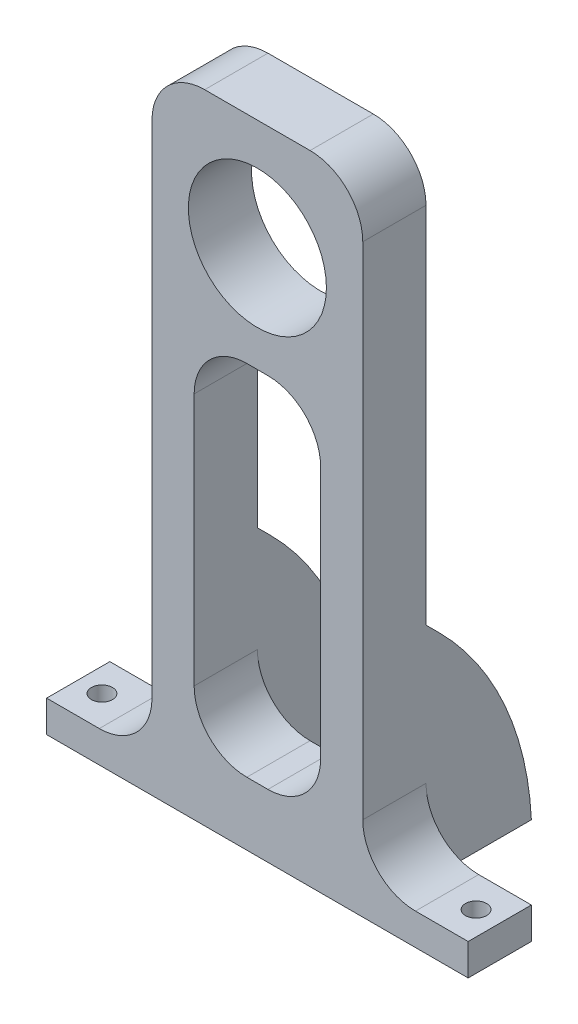
ISO-10303-21;
HEADER;
FILE_DESCRIPTION(('STEP AP214'),'2;1');
FILE_NAME('part.step','',(''),(''),'','','');
FILE_SCHEMA(('AUTOMOTIVE_DESIGN { 1 0 10303 214 1 1 1 1 }'));
ENDSEC;
DATA;
#1=APPLICATION_CONTEXT('core data for automotive mechanical design processes');
#2=APPLICATION_PROTOCOL_DEFINITION('international standard','automotive_design',2000,#1);
#3=PRODUCT_CONTEXT('',#1,'mechanical');
#4=PRODUCT('Part','Part','',(#3));
#5=PRODUCT_RELATED_PRODUCT_CATEGORY('part','',(#4));
#6=PRODUCT_DEFINITION_FORMATION('','',#4);
#7=PRODUCT_DEFINITION_CONTEXT('part definition',#1,'design');
#8=PRODUCT_DEFINITION('design','',#6,#7);
#9=PRODUCT_DEFINITION_SHAPE('','',#8);
#10=(LENGTH_UNIT() NAMED_UNIT(*) SI_UNIT(.MILLI.,.METRE.));
#11=(NAMED_UNIT(*) PLANE_ANGLE_UNIT() SI_UNIT($,.RADIAN.));
#12=(NAMED_UNIT(*) SI_UNIT($,.STERADIAN.) SOLID_ANGLE_UNIT());
#13=UNCERTAINTY_MEASURE_WITH_UNIT(LENGTH_MEASURE(1.E-05),#10,'distance_accuracy_value','');
#14=(GEOMETRIC_REPRESENTATION_CONTEXT(3) GLOBAL_UNCERTAINTY_ASSIGNED_CONTEXT((#13)) GLOBAL_UNIT_ASSIGNED_CONTEXT((#10,
#11,#12)) REPRESENTATION_CONTEXT('',''));
#15=CARTESIAN_POINT('',(0.,0.,0.));
#16=DIRECTION('',(0.,0.,1.));
#17=DIRECTION('',(1.,0.,0.));
#18=AXIS2_PLACEMENT_3D('',#15,#16,#17);
#19=CARTESIAN_POINT('',(-132.231048069346,30.1944444444444,0.));
#20=DIRECTION('',(0.,0.,1.));
#21=DIRECTION('',(1.,0.,0.));
#22=AXIS2_PLACEMENT_3D('',#19,#20,#21);
#23=PLANE('',#22);
#24=DIRECTION('',(0.,1.,0.));
#25=VECTOR('',#24,1.);
#26=CARTESIAN_POINT('',(-162.231048069346,-58.8055555555556,0.));
#27=LINE('',#26,#25);
#28=CARTESIAN_POINT('',(-162.231048069346,-80.8055555555556,0.));
#29=VERTEX_POINT('',#28);
#30=CARTESIAN_POINT('',(-162.231048069346,-64.8055555555556,0.));
#31=VERTEX_POINT('',#30);
#32=EDGE_CURVE('E229',#29,#31,#27,.T.);
#33=ORIENTED_EDGE('',*,*,#32,.F.);
#34=DIRECTION('',(1.,0.,0.));
#35=VECTOR('',#34,1.);
#36=CARTESIAN_POINT('',(-182.231048069346,-80.8055555555556,0.));
#37=LINE('',#36,#35);
#38=CARTESIAN_POINT('',(-182.231048069346,-80.8055555555556,0.));
#39=VERTEX_POINT('',#38);
#40=EDGE_CURVE('E359',#39,#29,#37,.T.);
#41=ORIENTED_EDGE('',*,*,#40,.F.);
#42=DIRECTION('',(0.,-1.,0.));
#43=VECTOR('',#42,1.);
#44=CARTESIAN_POINT('',(-182.231048069346,-74.8055555555556,0.));
#45=LINE('',#44,#43);
#46=CARTESIAN_POINT('',(-182.231048069346,-74.8055555555556,0.));
#47=VERTEX_POINT('',#46);
#48=EDGE_CURVE('E356',#47,#39,#45,.T.);
#49=ORIENTED_EDGE('',*,*,#48,.F.);
#50=DIRECTION('',(-1.,0.,0.));
#51=VECTOR('',#50,1.);
#52=CARTESIAN_POINT('',(-162.231048069346,-74.8055555555556,0.));
#53=LINE('',#52,#51);
#54=CARTESIAN_POINT('',(-172.231048069346,-74.8055555555556,0.));
#55=VERTEX_POINT('',#54);
#56=EDGE_CURVE('E328',#55,#47,#53,.T.);
#57=ORIENTED_EDGE('',*,*,#56,.F.);
#58=CARTESIAN_POINT('',(-172.231048069346,-64.8055555555556,0.));
#59=DIRECTION('',(0.,0.,1.));
#60=DIRECTION('',(1.,0.,0.));
#61=AXIS2_PLACEMENT_3D('',#58,#59,#60);
#62=CIRCLE('',#61,10.);
#63=EDGE_CURVE('E414',#55,#31,#62,.T.);
#64=ORIENTED_EDGE('',*,*,#63,.T.);
#65=EDGE_LOOP('',(#33,#41,#49,#57,#64));
#66=FACE_BOUND('',#65,.T.);
#67=ADVANCED_FACE('F34',(#66),#23,.F.);
#68=DIRECTION('',(0.,-1.,0.));
#69=VECTOR('',#68,1.);
#70=CARTESIAN_POINT('',(-154.231048069346,-58.8055555555556,0.));
#71=LINE('',#70,#69);
#72=CARTESIAN_POINT('',(-154.231048069346,-58.8055555555556,0.));
#73=VERTEX_POINT('',#72);
#74=CARTESIAN_POINT('',(-154.231048069346,-80.8055555555556,0.));
#75=VERTEX_POINT('',#74);
#76=EDGE_CURVE('E233',#73,#75,#71,.T.);
#77=ORIENTED_EDGE('',*,*,#76,.F.);
#78=CARTESIAN_POINT('',(-144.231048069346,-58.8055555555556,0.));
#79=DIRECTION('',(0.,0.,1.));
#80=DIRECTION('',(-1.,0.,0.));
#81=AXIS2_PLACEMENT_3D('',#78,#79,#80);
#82=CIRCLE('',#81,10.);
#83=CARTESIAN_POINT('',(-144.231048069346,-68.8055555555556,0.));
#84=VERTEX_POINT('',#83);
#85=EDGE_CURVE('E301',#73,#84,#82,.T.);
#86=ORIENTED_EDGE('',*,*,#85,.T.);
#87=DIRECTION('',(1.,0.,0.));
#88=VECTOR('',#87,1.);
#89=CARTESIAN_POINT('',(-144.231048069346,-68.8055555555556,0.));
#90=LINE('',#89,#88);
#91=CARTESIAN_POINT('',(-140.231048069346,-68.8055555555556,0.));
#92=VERTEX_POINT('',#91);
#93=EDGE_CURVE('E269',#84,#92,#90,.T.);
#94=ORIENTED_EDGE('',*,*,#93,.T.);
#95=CARTESIAN_POINT('',(-140.231048069346,-58.8055555555556,0.));
#96=DIRECTION('',(0.,0.,1.));
#97=DIRECTION('',(1.,0.,0.));
#98=AXIS2_PLACEMENT_3D('',#95,#96,#97);
#99=CIRCLE('',#98,10.);
#100=CARTESIAN_POINT('',(-130.231048069346,-58.8055555555555,0.));
#101=VERTEX_POINT('',#100);
#102=EDGE_CURVE('E285',#92,#101,#99,.T.);
#103=ORIENTED_EDGE('',*,*,#102,.T.);
#104=DIRECTION('',(0.,1.,0.));
#105=VECTOR('',#104,1.);
#106=CARTESIAN_POINT('',(-130.231048069346,-58.8055555555555,0.));
#107=LINE('',#106,#105);
#108=CARTESIAN_POINT('',(-130.231048069346,-80.8055555555556,0.));
#109=VERTEX_POINT('',#108);
#110=EDGE_CURVE('E235',#109,#101,#107,.T.);
#111=ORIENTED_EDGE('',*,*,#110,.F.);
#112=EDGE_CURVE('E362',#75,#109,#37,.T.);
#113=ORIENTED_EDGE('',*,*,#112,.F.);
#114=EDGE_LOOP('',(#77,#86,#94,#103,#111,#113));
#115=FACE_BOUND('',#114,.T.);
#116=ADVANCED_FACE('F553',(#115),#23,.F.);
#117=CARTESIAN_POINT('',(-142.231048069346,19.1944444444444,0.));
#118=DIRECTION('',(0.,0.,1.));
#119=DIRECTION('',(1.,0.,0.));
#120=AXIS2_PLACEMENT_3D('',#117,#118,#119);
#121=CIRCLE('',#120,13.1);
#122=CARTESIAN_POINT('',(-129.131048069346,19.1944444444444,0.));
#123=VERTEX_POINT('',#122);
#124=EDGE_CURVE('E324',#123,#123,#121,.T.);
#125=ORIENTED_EDGE('',*,*,#124,.T.);
#126=EDGE_LOOP('',(#125));
#127=FACE_BOUND('',#126,.T.);
#128=DIRECTION('',(0.,-1.,0.));
#129=VECTOR('',#128,1.);
#130=CARTESIAN_POINT('',(-154.231048069346,-10.8055555555557,0.));
#131=LINE('',#130,#129);
#132=CARTESIAN_POINT('',(-154.231048069346,-10.8055555555557,0.));
#133=VERTEX_POINT('',#132);
#134=CARTESIAN_POINT('',(-154.231048069346,-38.8055555555557,0.));
#135=VERTEX_POINT('',#134);
#136=EDGE_CURVE('E298',#133,#135,#131,.T.);
#137=ORIENTED_EDGE('',*,*,#136,.T.);
#138=DIRECTION('',(-1.,0.,0.));
#139=VECTOR('',#138,1.);
#140=CARTESIAN_POINT('',(-162.231048069346,-38.8055555555557,0.));
#141=LINE('',#140,#139);
#142=CARTESIAN_POINT('',(-162.231048069346,-38.8055555555557,0.));
#143=VERTEX_POINT('',#142);
#144=EDGE_CURVE('E421',#135,#143,#141,.T.);
#145=ORIENTED_EDGE('',*,*,#144,.T.);
#146=DIRECTION('',(0.,-1.,0.));
#147=VECTOR('',#146,1.);
#148=CARTESIAN_POINT('',(-162.231048069346,30.1944444444443,0.));
#149=LINE('',#148,#147);
#150=CARTESIAN_POINT('',(-162.231048069346,30.1944444444443,0.));
#151=VERTEX_POINT('',#150);
#152=EDGE_CURVE('E334',#151,#143,#149,.T.);
#153=ORIENTED_EDGE('',*,*,#152,.F.);
#154=CARTESIAN_POINT('',(-152.231048069346,30.1944444444444,0.));
#155=DIRECTION('',(0.,0.,1.));
#156=DIRECTION('',(-1.,0.,0.));
#157=AXIS2_PLACEMENT_3D('',#154,#155,#156);
#158=CIRCLE('',#157,10.);
#159=CARTESIAN_POINT('',(-152.231048069346,40.1944444444444,0.));
#160=VERTEX_POINT('',#159);
#161=EDGE_CURVE('E373',#160,#151,#158,.T.);
#162=ORIENTED_EDGE('',*,*,#161,.F.);
#163=DIRECTION('',(-1.,0.,0.));
#164=VECTOR('',#163,1.);
#165=CARTESIAN_POINT('',(-132.231048069346,40.1944444444444,0.));
#166=LINE('',#165,#164);
#167=CARTESIAN_POINT('',(-132.231048069346,40.1944444444444,0.));
#168=VERTEX_POINT('',#167);
#169=EDGE_CURVE('E371',#168,#160,#166,.T.);
#170=ORIENTED_EDGE('',*,*,#169,.F.);
#171=CARTESIAN_POINT('',(-132.231048069346,30.1944444444444,0.));
#172=DIRECTION('',(0.,0.,1.));
#173=DIRECTION('',(1.,0.,0.));
#174=AXIS2_PLACEMENT_3D('',#171,#172,#173);
#175=CIRCLE('',#174,10.);
#176=CARTESIAN_POINT('',(-122.231048069346,30.1944444444443,0.));
#177=VERTEX_POINT('',#176);
#178=EDGE_CURVE('E369',#177,#168,#175,.T.);
#179=ORIENTED_EDGE('',*,*,#178,.F.);
#180=DIRECTION('',(0.,1.,0.));
#181=VECTOR('',#180,1.);
#182=CARTESIAN_POINT('',(-122.231048069346,-74.8055555555556,0.));
#183=LINE('',#182,#181);
#184=CARTESIAN_POINT('',(-122.231048069346,-38.8055555555556,0.));
#185=VERTEX_POINT('',#184);
#186=EDGE_CURVE('E367',#185,#177,#183,.T.);
#187=ORIENTED_EDGE('',*,*,#186,.F.);
#188=DIRECTION('',(-1.,0.,0.));
#189=VECTOR('',#188,1.);
#190=CARTESIAN_POINT('',(-130.231048069346,-38.8055555555556,0.));
#191=LINE('',#190,#189);
#192=CARTESIAN_POINT('',(-130.231048069346,-38.8055555555556,0.));
#193=VERTEX_POINT('',#192);
#194=EDGE_CURVE('E248',#185,#193,#191,.T.);
#195=ORIENTED_EDGE('',*,*,#194,.T.);
#196=DIRECTION('',(0.,1.,0.));
#197=VECTOR('',#196,1.);
#198=CARTESIAN_POINT('',(-130.231048069346,-10.8055555555557,0.));
#199=LINE('',#198,#197);
#200=CARTESIAN_POINT('',(-130.231048069346,-10.8055555555557,0.));
#201=VERTEX_POINT('',#200);
#202=EDGE_CURVE('E287',#193,#201,#199,.T.);
#203=ORIENTED_EDGE('',*,*,#202,.T.);
#204=CARTESIAN_POINT('',(-140.231048069346,-10.8055555555556,0.));
#205=DIRECTION('',(0.,0.,1.));
#206=DIRECTION('',(1.,0.,0.));
#207=AXIS2_PLACEMENT_3D('',#204,#205,#206);
#208=CIRCLE('',#207,10.);
#209=CARTESIAN_POINT('',(-140.231048069346,-0.805555555555598,0.));
#210=VERTEX_POINT('',#209);
#211=EDGE_CURVE('E289',#201,#210,#208,.T.);
#212=ORIENTED_EDGE('',*,*,#211,.T.);
#213=DIRECTION('',(-1.,0.,0.));
#214=VECTOR('',#213,1.);
#215=CARTESIAN_POINT('',(-144.231048069346,-0.805555555555598,0.));
#216=LINE('',#215,#214);
#217=CARTESIAN_POINT('',(-144.231048069346,-0.805555555555592,0.));
#218=VERTEX_POINT('',#217);
#219=EDGE_CURVE('E292',#210,#218,#216,.T.);
#220=ORIENTED_EDGE('',*,*,#219,.T.);
#221=CARTESIAN_POINT('',(-144.231048069346,-10.8055555555556,0.));
#222=DIRECTION('',(0.,0.,1.));
#223=DIRECTION('',(-1.,0.,0.));
#224=AXIS2_PLACEMENT_3D('',#221,#222,#223);
#225=CIRCLE('',#224,10.);
#226=EDGE_CURVE('E295',#218,#133,#225,.T.);
#227=ORIENTED_EDGE('',*,*,#226,.T.);
#228=EDGE_LOOP('',(#137,#145,#153,#162,#170,#179,#187,#195,#203,#212,#220,#227));
#229=FACE_BOUND('',#228,.T.);
#230=ADVANCED_FACE('F456',(#127,#229),#23,.F.);
#231=DIRECTION('',(0.,-1.,0.));
#232=VECTOR('',#231,1.);
#233=CARTESIAN_POINT('',(-122.231048069346,-58.8055555555555,0.));
#234=LINE('',#233,#232);
#235=CARTESIAN_POINT('',(-122.231048069346,-64.8055555555556,0.));
#236=VERTEX_POINT('',#235);
#237=CARTESIAN_POINT('',(-122.231048069346,-80.8055555555556,0.));
#238=VERTEX_POINT('',#237);
#239=EDGE_CURVE('E246',#236,#238,#234,.T.);
#240=ORIENTED_EDGE('',*,*,#239,.F.);
#241=CARTESIAN_POINT('',(-112.231048069346,-64.8055555555556,0.));
#242=DIRECTION('',(0.,0.,1.));
#243=DIRECTION('',(1.,0.,0.));
#244=AXIS2_PLACEMENT_3D('',#241,#242,#243);
#245=CIRCLE('',#244,10.);
#246=CARTESIAN_POINT('',(-112.231048069346,-74.8055555555556,0.));
#247=VERTEX_POINT('',#246);
#248=EDGE_CURVE('E405',#236,#247,#245,.T.);
#249=ORIENTED_EDGE('',*,*,#248,.T.);
#250=DIRECTION('',(-1.,0.,0.));
#251=VECTOR('',#250,1.);
#252=CARTESIAN_POINT('',(-102.231048069346,-74.8055555555556,0.));
#253=LINE('',#252,#251);
#254=CARTESIAN_POINT('',(-102.231048069346,-74.8055555555556,0.));
#255=VERTEX_POINT('',#254);
#256=EDGE_CURVE('E364',#255,#247,#253,.T.);
#257=ORIENTED_EDGE('',*,*,#256,.F.);
#258=DIRECTION('',(0.,1.,0.));
#259=VECTOR('',#258,1.);
#260=CARTESIAN_POINT('',(-102.231048069346,-80.8055555555556,0.));
#261=LINE('',#260,#259);
#262=CARTESIAN_POINT('',(-102.231048069346,-80.8055555555556,0.));
#263=VERTEX_POINT('',#262);
#264=EDGE_CURVE('E361',#263,#255,#261,.T.);
#265=ORIENTED_EDGE('',*,*,#264,.F.);
#266=EDGE_CURVE('E358',#238,#263,#37,.T.);
#267=ORIENTED_EDGE('',*,*,#266,.F.);
#268=EDGE_LOOP('',(#240,#249,#257,#265,#267));
#269=FACE_BOUND('',#268,.T.);
#270=ADVANCED_FACE('F509',(#269),#23,.F.);
#271=CARTESIAN_POINT('',(-132.231048069346,30.1944444444444,12.));
#272=DIRECTION('',(0.,0.,1.));
#273=DIRECTION('',(1.,0.,0.));
#274=AXIS2_PLACEMENT_3D('',#271,#272,#273);
#275=PLANE('',#274);
#276=DIRECTION('',(0.,-1.,0.));
#277=VECTOR('',#276,1.);
#278=CARTESIAN_POINT('',(-162.231048069346,30.1944444444443,12.));
#279=LINE('',#278,#277);
#280=CARTESIAN_POINT('',(-162.231048069346,30.1944444444443,12.));
#281=VERTEX_POINT('',#280);
#282=CARTESIAN_POINT('',(-162.231048069346,-64.8055555555556,12.));
#283=VERTEX_POINT('',#282);
#284=EDGE_CURVE('E351',#281,#283,#279,.T.);
#285=ORIENTED_EDGE('',*,*,#284,.T.);
#286=CARTESIAN_POINT('',(-172.231048069346,-64.8055555555556,12.));
#287=DIRECTION('',(0.,0.,1.));
#288=DIRECTION('',(1.,0.,0.));
#289=AXIS2_PLACEMENT_3D('',#286,#287,#288);
#290=CIRCLE('',#289,10.);
#291=CARTESIAN_POINT('',(-172.231048069346,-74.8055555555556,12.));
#292=VERTEX_POINT('',#291);
#293=EDGE_CURVE('E249',#283,#292,#290,.F.);
#294=ORIENTED_EDGE('',*,*,#293,.T.);
#295=DIRECTION('',(-1.,0.,0.));
#296=VECTOR('',#295,1.);
#297=CARTESIAN_POINT('',(-162.231048069346,-74.8055555555556,12.));
#298=LINE('',#297,#296);
#299=CARTESIAN_POINT('',(-182.231048069346,-74.8055555555556,12.));
#300=VERTEX_POINT('',#299);
#301=EDGE_CURVE('E331',#292,#300,#298,.T.);
#302=ORIENTED_EDGE('',*,*,#301,.T.);
#303=DIRECTION('',(0.,-1.,0.));
#304=VECTOR('',#303,1.);
#305=CARTESIAN_POINT('',(-182.231048069346,-74.8055555555556,12.));
#306=LINE('',#305,#304);
#307=CARTESIAN_POINT('',(-182.231048069346,-80.8055555555556,12.));
#308=VERTEX_POINT('',#307);
#309=EDGE_CURVE('E333',#300,#308,#306,.T.);
#310=ORIENTED_EDGE('',*,*,#309,.T.);
#311=DIRECTION('',(1.,0.,0.));
#312=VECTOR('',#311,1.);
#313=CARTESIAN_POINT('',(-182.231048069346,-80.8055555555556,12.));
#314=LINE('',#313,#312);
#315=CARTESIAN_POINT('',(-102.231048069346,-80.8055555555556,12.));
#316=VERTEX_POINT('',#315);
#317=EDGE_CURVE('E336',#308,#316,#314,.T.);
#318=ORIENTED_EDGE('',*,*,#317,.T.);
#319=DIRECTION('',(0.,1.,0.));
#320=VECTOR('',#319,1.);
#321=CARTESIAN_POINT('',(-102.231048069346,-80.8055555555556,12.));
#322=LINE('',#321,#320);
#323=CARTESIAN_POINT('',(-102.231048069346,-74.8055555555556,12.));
#324=VERTEX_POINT('',#323);
#325=EDGE_CURVE('E338',#316,#324,#322,.T.);
#326=ORIENTED_EDGE('',*,*,#325,.T.);
#327=DIRECTION('',(-1.,0.,0.));
#328=VECTOR('',#327,1.);
#329=CARTESIAN_POINT('',(-102.231048069346,-74.8055555555556,12.));
#330=LINE('',#329,#328);
#331=CARTESIAN_POINT('',(-112.231048069346,-74.8055555555556,12.));
#332=VERTEX_POINT('',#331);
#333=EDGE_CURVE('E340',#324,#332,#330,.T.);
#334=ORIENTED_EDGE('',*,*,#333,.T.);
#335=CARTESIAN_POINT('',(-112.231048069346,-64.8055555555556,12.));
#336=DIRECTION('',(0.,0.,1.));
#337=DIRECTION('',(1.,0.,0.));
#338=AXIS2_PLACEMENT_3D('',#335,#336,#337);
#339=CIRCLE('',#338,10.);
#340=CARTESIAN_POINT('',(-122.231048069346,-64.8055555555556,12.));
#341=VERTEX_POINT('',#340);
#342=EDGE_CURVE('E407',#332,#341,#339,.F.);
#343=ORIENTED_EDGE('',*,*,#342,.T.);
#344=DIRECTION('',(0.,1.,0.));
#345=VECTOR('',#344,1.);
#346=CARTESIAN_POINT('',(-122.231048069346,-74.8055555555556,12.));
#347=LINE('',#346,#345);
#348=CARTESIAN_POINT('',(-122.231048069346,30.1944444444443,12.));
#349=VERTEX_POINT('',#348);
#350=EDGE_CURVE('E343',#341,#349,#347,.T.);
#351=ORIENTED_EDGE('',*,*,#350,.T.);
#352=CARTESIAN_POINT('',(-132.231048069346,30.1944444444444,12.));
#353=DIRECTION('',(0.,0.,1.));
#354=DIRECTION('',(1.,0.,0.));
#355=AXIS2_PLACEMENT_3D('',#352,#353,#354);
#356=CIRCLE('',#355,10.);
#357=CARTESIAN_POINT('',(-132.231048069346,40.1944444444444,12.));
#358=VERTEX_POINT('',#357);
#359=EDGE_CURVE('E345',#349,#358,#356,.T.);
#360=ORIENTED_EDGE('',*,*,#359,.T.);
#361=DIRECTION('',(-1.,0.,0.));
#362=VECTOR('',#361,1.);
#363=CARTESIAN_POINT('',(-132.231048069346,40.1944444444444,12.));
#364=LINE('',#363,#362);
#365=CARTESIAN_POINT('',(-152.231048069346,40.1944444444444,12.));
#366=VERTEX_POINT('',#365);
#367=EDGE_CURVE('E347',#358,#366,#364,.T.);
#368=ORIENTED_EDGE('',*,*,#367,.T.);
#369=CARTESIAN_POINT('',(-152.231048069346,30.1944444444444,12.));
#370=DIRECTION('',(0.,0.,1.));
#371=DIRECTION('',(-1.,0.,0.));
#372=AXIS2_PLACEMENT_3D('',#369,#370,#371);
#373=CIRCLE('',#372,10.);
#374=EDGE_CURVE('E349',#366,#281,#373,.T.);
#375=ORIENTED_EDGE('',*,*,#374,.T.);
#376=EDGE_LOOP('',(#285,#294,#302,#310,#318,#326,#334,#343,#351,#360,#368,#375));
#377=FACE_BOUND('',#376,.T.);
#378=CARTESIAN_POINT('',(-142.231048069346,19.1944444444444,12.));
#379=DIRECTION('',(0.,0.,1.));
#380=DIRECTION('',(1.,0.,0.));
#381=AXIS2_PLACEMENT_3D('',#378,#379,#380);
#382=CIRCLE('',#381,13.1);
#383=CARTESIAN_POINT('',(-129.131048069346,19.1944444444444,12.));
#384=VERTEX_POINT('',#383);
#385=EDGE_CURVE('E325',#384,#384,#382,.T.);
#386=ORIENTED_EDGE('',*,*,#385,.F.);
#387=EDGE_LOOP('',(#386));
#388=FACE_BOUND('',#387,.T.);
#389=DIRECTION('',(0.,1.,0.));
#390=VECTOR('',#389,1.);
#391=CARTESIAN_POINT('',(-130.231048069346,-10.8055555555557,12.));
#392=LINE('',#391,#390);
#393=CARTESIAN_POINT('',(-130.231048069346,-58.8055555555555,12.));
#394=VERTEX_POINT('',#393);
#395=CARTESIAN_POINT('',(-130.231048069346,-10.8055555555557,12.));
#396=VERTEX_POINT('',#395);
#397=EDGE_CURVE('E268',#394,#396,#392,.T.);
#398=ORIENTED_EDGE('',*,*,#397,.F.);
#399=CARTESIAN_POINT('',(-140.231048069346,-58.8055555555556,12.));
#400=DIRECTION('',(0.,0.,1.));
#401=DIRECTION('',(1.,0.,0.));
#402=AXIS2_PLACEMENT_3D('',#399,#400,#401);
#403=CIRCLE('',#402,10.);
#404=CARTESIAN_POINT('',(-140.231048069346,-68.8055555555556,12.));
#405=VERTEX_POINT('',#404);
#406=EDGE_CURVE('E266',#405,#394,#403,.T.);
#407=ORIENTED_EDGE('',*,*,#406,.F.);
#408=DIRECTION('',(1.,0.,0.));
#409=VECTOR('',#408,1.);
#410=CARTESIAN_POINT('',(-144.231048069346,-68.8055555555556,12.));
#411=LINE('',#410,#409);
#412=CARTESIAN_POINT('',(-144.231048069346,-68.8055555555556,12.));
#413=VERTEX_POINT('',#412);
#414=EDGE_CURVE('E282',#413,#405,#411,.T.);
#415=ORIENTED_EDGE('',*,*,#414,.F.);
#416=CARTESIAN_POINT('',(-144.231048069346,-58.8055555555556,12.));
#417=DIRECTION('',(0.,0.,1.));
#418=DIRECTION('',(-1.,0.,0.));
#419=AXIS2_PLACEMENT_3D('',#416,#417,#418);
#420=CIRCLE('',#419,10.);
#421=CARTESIAN_POINT('',(-154.231048069346,-58.8055555555556,12.));
#422=VERTEX_POINT('',#421);
#423=EDGE_CURVE('E279',#422,#413,#420,.T.);
#424=ORIENTED_EDGE('',*,*,#423,.F.);
#425=DIRECTION('',(0.,-1.,0.));
#426=VECTOR('',#425,1.);
#427=CARTESIAN_POINT('',(-154.231048069346,-10.8055555555557,12.));
#428=LINE('',#427,#426);
#429=CARTESIAN_POINT('',(-154.231048069346,-10.8055555555557,12.));
#430=VERTEX_POINT('',#429);
#431=EDGE_CURVE('E277',#430,#422,#428,.T.);
#432=ORIENTED_EDGE('',*,*,#431,.F.);
#433=CARTESIAN_POINT('',(-144.231048069346,-10.8055555555556,12.));
#434=DIRECTION('',(0.,0.,1.));
#435=DIRECTION('',(-1.,0.,0.));
#436=AXIS2_PLACEMENT_3D('',#433,#434,#435);
#437=CIRCLE('',#436,10.);
#438=CARTESIAN_POINT('',(-144.231048069346,-0.805555555555592,12.));
#439=VERTEX_POINT('',#438);
#440=EDGE_CURVE('E275',#439,#430,#437,.T.);
#441=ORIENTED_EDGE('',*,*,#440,.F.);
#442=DIRECTION('',(-1.,0.,0.));
#443=VECTOR('',#442,1.);
#444=CARTESIAN_POINT('',(-144.231048069346,-0.805555555555598,12.));
#445=LINE('',#444,#443);
#446=CARTESIAN_POINT('',(-140.231048069346,-0.805555555555598,12.));
#447=VERTEX_POINT('',#446);
#448=EDGE_CURVE('E273',#447,#439,#445,.T.);
#449=ORIENTED_EDGE('',*,*,#448,.F.);
#450=CARTESIAN_POINT('',(-140.231048069346,-10.8055555555556,12.));
#451=DIRECTION('',(0.,0.,1.));
#452=DIRECTION('',(1.,0.,0.));
#453=AXIS2_PLACEMENT_3D('',#450,#451,#452);
#454=CIRCLE('',#453,10.);
#455=EDGE_CURVE('E271',#396,#447,#454,.T.);
#456=ORIENTED_EDGE('',*,*,#455,.F.);
#457=EDGE_LOOP('',(#398,#407,#415,#424,#432,#441,#449,#456));
#458=FACE_BOUND('',#457,.T.);
#459=ADVANCED_FACE('F522',(#377,#388,#458),#275,.T.);
#460=CARTESIAN_POINT('',(-162.231048069346,-74.8055555555556,12.));
#461=DIRECTION('',(0.,-1.,0.));
#462=DIRECTION('',(0.,0.,-1.));
#463=AXIS2_PLACEMENT_3D('',#460,#461,#462);
#464=PLANE('',#463);
#465=CARTESIAN_POINT('',(-177.731048069346,-74.8055555555556,6.));
#466=DIRECTION('',(0.,1.,0.));
#467=DIRECTION('',(0.,0.,1.));
#468=AXIS2_PLACEMENT_3D('',#465,#466,#467);
#469=CIRCLE('',#468,2.);
#470=CARTESIAN_POINT('',(-177.731048069346,-74.8055555555556,8.));
#471=VERTEX_POINT('',#470);
#472=EDGE_CURVE('E256',#471,#471,#469,.T.);
#473=ORIENTED_EDGE('',*,*,#472,.F.);
#474=EDGE_LOOP('',(#473));
#475=FACE_BOUND('',#474,.T.);
#476=ORIENTED_EDGE('',*,*,#301,.F.);
#477=DIRECTION('',(0.,0.,-1.));
#478=VECTOR('',#477,1.);
#479=CARTESIAN_POINT('',(-172.231048069346,-74.8055555555556,0.));
#480=LINE('',#479,#478);
#481=EDGE_CURVE('E409',#292,#55,#480,.T.);
#482=ORIENTED_EDGE('',*,*,#481,.T.);
#483=ORIENTED_EDGE('',*,*,#56,.T.);
#484=DIRECTION('',(0.,0.,-1.));
#485=VECTOR('',#484,1.);
#486=CARTESIAN_POINT('',(-182.231048069346,-74.8055555555556,12.));
#487=LINE('',#486,#485);
#488=EDGE_CURVE('E397',#300,#47,#487,.T.);
#489=ORIENTED_EDGE('',*,*,#488,.F.);
#490=EDGE_LOOP('',(#476,#482,#483,#489));
#491=FACE_BOUND('',#490,.T.);
#492=ADVANCED_FACE('F540',(#475,#491),#464,.F.);
#493=CARTESIAN_POINT('',(-182.231048069346,-74.8055555555556,12.));
#494=DIRECTION('',(1.,0.,0.));
#495=DIRECTION('',(0.,1.,0.));
#496=AXIS2_PLACEMENT_3D('',#493,#494,#495);
#497=PLANE('',#496);
#498=ORIENTED_EDGE('',*,*,#48,.T.);
#499=DIRECTION('',(0.,0.,-1.));
#500=VECTOR('',#499,1.);
#501=CARTESIAN_POINT('',(-182.231048069346,-80.8055555555556,12.));
#502=LINE('',#501,#500);
#503=EDGE_CURVE('E394',#308,#39,#502,.T.);
#504=ORIENTED_EDGE('',*,*,#503,.F.);
#505=ORIENTED_EDGE('',*,*,#309,.F.);
#506=ORIENTED_EDGE('',*,*,#488,.T.);
#507=EDGE_LOOP('',(#498,#504,#505,#506));
#508=FACE_BOUND('',#507,.T.);
#509=ADVANCED_FACE('F528',(#508),#497,.F.);
#510=CARTESIAN_POINT('',(-182.231048069346,-80.8055555555556,12.));
#511=DIRECTION('',(0.,1.,0.));
#512=DIRECTION('',(-1.,0.,0.));
#513=AXIS2_PLACEMENT_3D('',#510,#511,#512);
#514=PLANE('',#513);
#515=CARTESIAN_POINT('',(-106.731048069346,-80.8055555555556,6.));
#516=DIRECTION('',(0.,1.,0.));
#517=DIRECTION('',(-1.,0.,0.));
#518=AXIS2_PLACEMENT_3D('',#515,#516,#517);
#519=CIRCLE('',#518,2.);
#520=CARTESIAN_POINT('',(-108.731048069346,-80.8055555555556,6.));
#521=VERTEX_POINT('',#520);
#522=EDGE_CURVE('E260',#521,#521,#519,.T.);
#523=ORIENTED_EDGE('',*,*,#522,.T.);
#524=EDGE_LOOP('',(#523));
#525=FACE_BOUND('',#524,.T.);
#526=CARTESIAN_POINT('',(-177.731048069346,-80.8055555555556,6.));
#527=DIRECTION('',(0.,1.,0.));
#528=DIRECTION('',(-1.,0.,0.));
#529=AXIS2_PLACEMENT_3D('',#526,#527,#528);
#530=CIRCLE('',#529,2.);
#531=CARTESIAN_POINT('',(-179.731048069346,-80.8055555555556,6.));
#532=VERTEX_POINT('',#531);
#533=EDGE_CURVE('E265',#532,#532,#530,.T.);
#534=ORIENTED_EDGE('',*,*,#533,.T.);
#535=EDGE_LOOP('',(#534));
#536=FACE_BOUND('',#535,.T.);
#537=ORIENTED_EDGE('',*,*,#40,.T.);
#538=DIRECTION('',(0.,0.,1.));
#539=VECTOR('',#538,1.);
#540=CARTESIAN_POINT('',(-162.231048069346,-80.8055555555556,-20.));
#541=LINE('',#540,#539);
#542=CARTESIAN_POINT('',(-162.231048069346,-80.8055555555556,-20.));
#543=VERTEX_POINT('',#542);
#544=EDGE_CURVE('E228',#543,#29,#541,.T.);
#545=ORIENTED_EDGE('',*,*,#544,.F.);
#546=DIRECTION('',(-1.,0.,0.));
#547=VECTOR('',#546,1.);
#548=CARTESIAN_POINT('',(-154.231048069346,-80.8055555555556,-20.));
#549=LINE('',#548,#547);
#550=CARTESIAN_POINT('',(-154.231048069346,-80.8055555555556,-20.));
#551=VERTEX_POINT('',#550);
#552=EDGE_CURVE('E219',#551,#543,#549,.T.);
#553=ORIENTED_EDGE('',*,*,#552,.F.);
#554=DIRECTION('',(0.,0.,1.));
#555=VECTOR('',#554,1.);
#556=CARTESIAN_POINT('',(-154.231048069346,-80.8055555555556,-20.));
#557=LINE('',#556,#555);
#558=EDGE_CURVE('E226',#551,#75,#557,.T.);
#559=ORIENTED_EDGE('',*,*,#558,.T.);
#560=ORIENTED_EDGE('',*,*,#112,.T.);
#561=DIRECTION('',(0.,0.,1.));
#562=VECTOR('',#561,1.);
#563=CARTESIAN_POINT('',(-130.231048069346,-80.8055555555556,-20.));
#564=LINE('',#563,#562);
#565=CARTESIAN_POINT('',(-130.231048069346,-80.8055555555556,-20.));
#566=VERTEX_POINT('',#565);
#567=EDGE_CURVE('E245',#566,#109,#564,.T.);
#568=ORIENTED_EDGE('',*,*,#567,.F.);
#569=DIRECTION('',(-1.,0.,0.));
#570=VECTOR('',#569,1.);
#571=CARTESIAN_POINT('',(-122.231048069346,-80.8055555555556,-20.));
#572=LINE('',#571,#570);
#573=CARTESIAN_POINT('',(-122.231048069346,-80.8055555555556,-20.));
#574=VERTEX_POINT('',#573);
#575=EDGE_CURVE('E238',#574,#566,#572,.T.);
#576=ORIENTED_EDGE('',*,*,#575,.F.);
#577=DIRECTION('',(0.,0.,1.));
#578=VECTOR('',#577,1.);
#579=CARTESIAN_POINT('',(-122.231048069346,-80.8055555555556,-20.));
#580=LINE('',#579,#578);
#581=EDGE_CURVE('E253',#574,#238,#580,.T.);
#582=ORIENTED_EDGE('',*,*,#581,.T.);
#583=ORIENTED_EDGE('',*,*,#266,.T.);
#584=DIRECTION('',(0.,0.,-1.));
#585=VECTOR('',#584,1.);
#586=CARTESIAN_POINT('',(-102.231048069346,-80.8055555555556,12.));
#587=LINE('',#586,#585);
#588=EDGE_CURVE('E391',#316,#263,#587,.T.);
#589=ORIENTED_EDGE('',*,*,#588,.F.);
#590=ORIENTED_EDGE('',*,*,#317,.F.);
#591=ORIENTED_EDGE('',*,*,#503,.T.);
#592=EDGE_LOOP('',(#537,#545,#553,#559,#560,#568,#576,#582,#583,#589,#590,#591));
#593=FACE_BOUND('',#592,.T.);
#594=ADVANCED_FACE('F225',(#525,#536,#593),#514,.F.);
#595=CARTESIAN_POINT('',(-102.231048069346,-80.8055555555556,12.));
#596=DIRECTION('',(-1.,0.,0.));
#597=DIRECTION('',(0.,0.,1.));
#598=AXIS2_PLACEMENT_3D('',#595,#596,#597);
#599=PLANE('',#598);
#600=ORIENTED_EDGE('',*,*,#264,.T.);
#601=DIRECTION('',(0.,0.,-1.));
#602=VECTOR('',#601,1.);
#603=CARTESIAN_POINT('',(-102.231048069346,-74.8055555555556,12.));
#604=LINE('',#603,#602);
#605=EDGE_CURVE('E388',#324,#255,#604,.T.);
#606=ORIENTED_EDGE('',*,*,#605,.F.);
#607=ORIENTED_EDGE('',*,*,#325,.F.);
#608=ORIENTED_EDGE('',*,*,#588,.T.);
#609=EDGE_LOOP('',(#600,#606,#607,#608));
#610=FACE_BOUND('',#609,.T.);
#611=ADVANCED_FACE('F517',(#610),#599,.F.);
#612=CARTESIAN_POINT('',(-102.231048069346,-74.8055555555556,12.));
#613=DIRECTION('',(0.,-1.,0.));
#614=DIRECTION('',(0.,0.,-1.));
#615=AXIS2_PLACEMENT_3D('',#612,#613,#614);
#616=PLANE('',#615);
#617=CARTESIAN_POINT('',(-106.731048069346,-74.8055555555556,6.));
#618=DIRECTION('',(0.,1.,0.));
#619=DIRECTION('',(0.,0.,1.));
#620=AXIS2_PLACEMENT_3D('',#617,#618,#619);
#621=CIRCLE('',#620,2.);
#622=CARTESIAN_POINT('',(-106.731048069346,-74.8055555555556,8.));
#623=VERTEX_POINT('',#622);
#624=EDGE_CURVE('E257',#623,#623,#621,.T.);
#625=ORIENTED_EDGE('',*,*,#624,.F.);
#626=EDGE_LOOP('',(#625));
#627=FACE_BOUND('',#626,.T.);
#628=ORIENTED_EDGE('',*,*,#256,.T.);
#629=DIRECTION('',(0.,0.,-1.));
#630=VECTOR('',#629,1.);
#631=CARTESIAN_POINT('',(-112.231048069346,-74.8055555555556,12.));
#632=LINE('',#631,#630);
#633=EDGE_CURVE('E403',#247,#332,#632,.F.);
#634=ORIENTED_EDGE('',*,*,#633,.T.);
#635=ORIENTED_EDGE('',*,*,#333,.F.);
#636=ORIENTED_EDGE('',*,*,#605,.T.);
#637=EDGE_LOOP('',(#628,#634,#635,#636));
#638=FACE_BOUND('',#637,.T.);
#639=ADVANCED_FACE('F512',(#627,#638),#616,.F.);
#640=CARTESIAN_POINT('',(-122.231048069346,-74.8055555555556,12.));
#641=DIRECTION('',(-1.,0.,0.));
#642=DIRECTION('',(0.,0.,1.));
#643=AXIS2_PLACEMENT_3D('',#640,#641,#642);
#644=PLANE('',#643);
#645=ORIENTED_EDGE('',*,*,#581,.F.);
#646=CARTESIAN_POINT('',(-122.231048069346,-83.7296651304559,39.9287041674853));
#647=DIRECTION('',(-1.,0.,0.));
#648=DIRECTION('',(0.,0.,1.));
#649=AXIS2_PLACEMENT_3D('',#646,#647,#648);
#650=CIRCLE('',#649,60.);
#651=CARTESIAN_POINT('',(-122.231048069346,-41.303258259263,-2.4977027037074));
#652=VERTEX_POINT('',#651);
#653=EDGE_CURVE('E432',#574,#652,#650,.F.);
#654=ORIENTED_EDGE('',*,*,#653,.T.);
#655=DIRECTION('',(0.,-0.707106781186546,-0.707106781186549));
#656=VECTOR('',#655,1.);
#657=CARTESIAN_POINT('',(-122.231048069346,-50.8055555555555,-12.));
#658=LINE('',#657,#656);
#659=EDGE_CURVE('E427',#652,#185,#658,.F.);
#660=ORIENTED_EDGE('',*,*,#659,.T.);
#661=ORIENTED_EDGE('',*,*,#186,.T.);
#662=DIRECTION('',(0.,0.,-1.));
#663=VECTOR('',#662,1.);
#664=CARTESIAN_POINT('',(-122.231048069346,30.1944444444443,12.));
#665=LINE('',#664,#663);
#666=EDGE_CURVE('E385',#349,#177,#665,.T.);
#667=ORIENTED_EDGE('',*,*,#666,.F.);
#668=ORIENTED_EDGE('',*,*,#350,.F.);
#669=DIRECTION('',(0.,0.,-1.));
#670=VECTOR('',#669,1.);
#671=CARTESIAN_POINT('',(-122.231048069346,-64.8055555555556,0.));
#672=LINE('',#671,#670);
#673=EDGE_CURVE('E400',#341,#236,#672,.T.);
#674=ORIENTED_EDGE('',*,*,#673,.T.);
#675=ORIENTED_EDGE('',*,*,#239,.T.);
#676=EDGE_LOOP('',(#645,#654,#660,#661,#667,#668,#674,#675));
#677=FACE_BOUND('',#676,.T.);
#678=ADVANCED_FACE('F450',(#677),#644,.F.);
#679=CARTESIAN_POINT('',(-132.231048069346,30.1944444444444,12.));
#680=DIRECTION('',(0.,0.,-1.));
#681=DIRECTION('',(-1.,0.,0.));
#682=AXIS2_PLACEMENT_3D('',#679,#680,#681);
#683=CYLINDRICAL_SURFACE('',#682,10.);
#684=ORIENTED_EDGE('',*,*,#178,.T.);
#685=DIRECTION('',(0.,0.,-1.));
#686=VECTOR('',#685,1.);
#687=CARTESIAN_POINT('',(-132.231048069346,40.1944444444444,12.));
#688=LINE('',#687,#686);
#689=EDGE_CURVE('E382',#358,#168,#688,.T.);
#690=ORIENTED_EDGE('',*,*,#689,.F.);
#691=ORIENTED_EDGE('',*,*,#359,.F.);
#692=ORIENTED_EDGE('',*,*,#666,.T.);
#693=EDGE_LOOP('',(#684,#690,#691,#692));
#694=FACE_BOUND('',#693,.T.);
#695=ADVANCED_FACE('F497',(#694),#683,.T.);
#696=CARTESIAN_POINT('',(-132.231048069346,40.1944444444444,12.));
#697=DIRECTION('',(0.,-1.,0.));
#698=DIRECTION('',(1.,0.,0.));
#699=AXIS2_PLACEMENT_3D('',#696,#697,#698);
#700=PLANE('',#699);
#701=ORIENTED_EDGE('',*,*,#169,.T.);
#702=DIRECTION('',(0.,0.,-1.));
#703=VECTOR('',#702,1.);
#704=CARTESIAN_POINT('',(-152.231048069346,40.1944444444444,12.));
#705=LINE('',#704,#703);
#706=EDGE_CURVE('E379',#366,#160,#705,.T.);
#707=ORIENTED_EDGE('',*,*,#706,.F.);
#708=ORIENTED_EDGE('',*,*,#367,.F.);
#709=ORIENTED_EDGE('',*,*,#689,.T.);
#710=EDGE_LOOP('',(#701,#707,#708,#709));
#711=FACE_BOUND('',#710,.T.);
#712=ADVANCED_FACE('F493',(#711),#700,.F.);
#713=CARTESIAN_POINT('',(-152.231048069346,30.1944444444444,12.));
#714=DIRECTION('',(0.,0.,-1.));
#715=DIRECTION('',(-1.,0.,0.));
#716=AXIS2_PLACEMENT_3D('',#713,#714,#715);
#717=CYLINDRICAL_SURFACE('',#716,10.);
#718=ORIENTED_EDGE('',*,*,#161,.T.);
#719=DIRECTION('',(0.,0.,-1.));
#720=VECTOR('',#719,1.);
#721=CARTESIAN_POINT('',(-162.231048069346,30.1944444444443,12.));
#722=LINE('',#721,#720);
#723=EDGE_CURVE('E354',#281,#151,#722,.T.);
#724=ORIENTED_EDGE('',*,*,#723,.F.);
#725=ORIENTED_EDGE('',*,*,#374,.F.);
#726=ORIENTED_EDGE('',*,*,#706,.T.);
#727=EDGE_LOOP('',(#718,#724,#725,#726));
#728=FACE_BOUND('',#727,.T.);
#729=ADVANCED_FACE('F488',(#728),#717,.T.);
#730=CARTESIAN_POINT('',(-162.231048069346,30.1944444444443,12.));
#731=DIRECTION('',(1.,0.,0.));
#732=DIRECTION('',(0.,0.,-1.));
#733=AXIS2_PLACEMENT_3D('',#730,#731,#732);
#734=PLANE('',#733);
#735=DIRECTION('',(0.,0.707106781186546,0.707106781186549));
#736=VECTOR('',#735,1.);
#737=CARTESIAN_POINT('',(-162.231048069346,1.69444444444415,40.5));
#738=LINE('',#737,#736);
#739=CARTESIAN_POINT('',(-162.231048069346,-41.3032582592631,-2.4977027037074));
#740=VERTEX_POINT('',#739);
#741=EDGE_CURVE('E425',#143,#740,#738,.F.);
#742=ORIENTED_EDGE('',*,*,#741,.T.);
#743=CARTESIAN_POINT('',(-162.231048069346,-83.729665130456,39.9287041674853));
#744=DIRECTION('',(1.,0.,0.));
#745=DIRECTION('',(0.,0.,-1.));
#746=AXIS2_PLACEMENT_3D('',#743,#744,#745);
#747=CIRCLE('',#746,60.);
#748=EDGE_CURVE('E11',#740,#543,#747,.F.);
#749=ORIENTED_EDGE('',*,*,#748,.T.);
#750=ORIENTED_EDGE('',*,*,#544,.T.);
#751=ORIENTED_EDGE('',*,*,#32,.T.);
#752=DIRECTION('',(0.,0.,-1.));
#753=VECTOR('',#752,1.);
#754=CARTESIAN_POINT('',(-162.231048069346,-64.8055555555556,12.));
#755=LINE('',#754,#753);
#756=EDGE_CURVE('E412',#31,#283,#755,.F.);
#757=ORIENTED_EDGE('',*,*,#756,.T.);
#758=ORIENTED_EDGE('',*,*,#284,.F.);
#759=ORIENTED_EDGE('',*,*,#723,.T.);
#760=ORIENTED_EDGE('',*,*,#152,.T.);
#761=EDGE_LOOP('',(#742,#749,#750,#751,#757,#758,#759,#760));
#762=FACE_BOUND('',#761,.T.);
#763=ADVANCED_FACE('F482',(#762),#734,.F.);
#764=CARTESIAN_POINT('',(-142.231048069346,19.1944444444444,12.));
#765=DIRECTION('',(0.,0.,-1.));
#766=DIRECTION('',(-1.,0.,0.));
#767=AXIS2_PLACEMENT_3D('',#764,#765,#766);
#768=CYLINDRICAL_SURFACE('',#767,13.1);
#769=ORIENTED_EDGE('',*,*,#385,.T.);
#770=EDGE_LOOP('',(#769));
#771=FACE_BOUND('',#770,.T.);
#772=ORIENTED_EDGE('',*,*,#124,.F.);
#773=EDGE_LOOP('',(#772));
#774=FACE_BOUND('',#773,.T.);
#775=ADVANCED_FACE('F569',(#771,#774),#768,.F.);
#776=CARTESIAN_POINT('',(-140.231048069346,-58.8055555555556,12.));
#777=DIRECTION('',(0.,0.,-1.));
#778=DIRECTION('',(-1.,0.,0.));
#779=AXIS2_PLACEMENT_3D('',#776,#777,#778);
#780=CYLINDRICAL_SURFACE('',#779,10.);
#781=ORIENTED_EDGE('',*,*,#102,.F.);
#782=DIRECTION('',(0.,0.,-1.));
#783=VECTOR('',#782,1.);
#784=CARTESIAN_POINT('',(-140.231048069346,-68.8055555555556,12.));
#785=LINE('',#784,#783);
#786=EDGE_CURVE('E284',#405,#92,#785,.T.);
#787=ORIENTED_EDGE('',*,*,#786,.F.);
#788=ORIENTED_EDGE('',*,*,#406,.T.);
#789=DIRECTION('',(0.,0.,-1.));
#790=VECTOR('',#789,1.);
#791=CARTESIAN_POINT('',(-130.231048069346,-58.8055555555555,12.));
#792=LINE('',#791,#790);
#793=EDGE_CURVE('E321',#394,#101,#792,.T.);
#794=ORIENTED_EDGE('',*,*,#793,.T.);
#795=EDGE_LOOP('',(#781,#787,#788,#794));
#796=FACE_BOUND('',#795,.T.);
#797=ADVANCED_FACE('F571',(#796),#780,.F.);
#798=CARTESIAN_POINT('',(-130.231048069346,-10.8055555555557,12.));
#799=DIRECTION('',(-1.,0.,0.));
#800=DIRECTION('',(0.,0.,1.));
#801=AXIS2_PLACEMENT_3D('',#798,#799,#800);
#802=PLANE('',#801);
#803=DIRECTION('',(0.,0.707106781186546,0.707106781186549));
#804=VECTOR('',#803,1.);
#805=CARTESIAN_POINT('',(-130.231048069346,-58.8055555555555,-20.));
#806=LINE('',#805,#804);
#807=CARTESIAN_POINT('',(-130.231048069346,-41.303258259263,-2.49770270370741));
#808=VERTEX_POINT('',#807);
#809=EDGE_CURVE('E429',#193,#808,#806,.F.);
#810=ORIENTED_EDGE('',*,*,#809,.T.);
#811=CARTESIAN_POINT('',(-130.231048069346,-83.7296651304559,39.9287041674853));
#812=DIRECTION('',(-1.,0.,0.));
#813=DIRECTION('',(0.,0.,1.));
#814=AXIS2_PLACEMENT_3D('',#811,#812,#813);
#815=CIRCLE('',#814,60.);
#816=EDGE_CURVE('E220',#808,#566,#815,.T.);
#817=ORIENTED_EDGE('',*,*,#816,.T.);
#818=ORIENTED_EDGE('',*,*,#567,.T.);
#819=ORIENTED_EDGE('',*,*,#110,.T.);
#820=ORIENTED_EDGE('',*,*,#793,.F.);
#821=ORIENTED_EDGE('',*,*,#397,.T.);
#822=DIRECTION('',(0.,0.,-1.));
#823=VECTOR('',#822,1.);
#824=CARTESIAN_POINT('',(-130.231048069346,-10.8055555555557,12.));
#825=LINE('',#824,#823);
#826=EDGE_CURVE('E318',#396,#201,#825,.T.);
#827=ORIENTED_EDGE('',*,*,#826,.T.);
#828=ORIENTED_EDGE('',*,*,#202,.F.);
#829=EDGE_LOOP('',(#810,#817,#818,#819,#820,#821,#827,#828));
#830=FACE_BOUND('',#829,.T.);
#831=ADVANCED_FACE('F439',(#830),#802,.T.);
#832=CARTESIAN_POINT('',(-140.231048069346,-10.8055555555556,12.));
#833=DIRECTION('',(0.,0.,-1.));
#834=DIRECTION('',(-1.,0.,0.));
#835=AXIS2_PLACEMENT_3D('',#832,#833,#834);
#836=CYLINDRICAL_SURFACE('',#835,10.);
#837=ORIENTED_EDGE('',*,*,#211,.F.);
#838=ORIENTED_EDGE('',*,*,#826,.F.);
#839=ORIENTED_EDGE('',*,*,#455,.T.);
#840=DIRECTION('',(0.,0.,-1.));
#841=VECTOR('',#840,1.);
#842=CARTESIAN_POINT('',(-140.231048069346,-0.805555555555598,12.));
#843=LINE('',#842,#841);
#844=EDGE_CURVE('E316',#447,#210,#843,.T.);
#845=ORIENTED_EDGE('',*,*,#844,.T.);
#846=EDGE_LOOP('',(#837,#838,#839,#845));
#847=FACE_BOUND('',#846,.T.);
#848=ADVANCED_FACE('F464',(#847),#836,.F.);
#849=CARTESIAN_POINT('',(-144.231048069346,-0.805555555555598,12.));
#850=DIRECTION('',(0.,-1.,0.));
#851=DIRECTION('',(0.,0.,-1.));
#852=AXIS2_PLACEMENT_3D('',#849,#850,#851);
#853=PLANE('',#852);
#854=ORIENTED_EDGE('',*,*,#219,.F.);
#855=ORIENTED_EDGE('',*,*,#844,.F.);
#856=ORIENTED_EDGE('',*,*,#448,.T.);
#857=DIRECTION('',(0.,0.,-1.));
#858=VECTOR('',#857,1.);
#859=CARTESIAN_POINT('',(-144.231048069346,-0.805555555555592,12.));
#860=LINE('',#859,#858);
#861=EDGE_CURVE('E314',#439,#218,#860,.T.);
#862=ORIENTED_EDGE('',*,*,#861,.T.);
#863=EDGE_LOOP('',(#854,#855,#856,#862));
#864=FACE_BOUND('',#863,.T.);
#865=ADVANCED_FACE('F469',(#864),#853,.T.);
#866=CARTESIAN_POINT('',(-144.231048069346,-10.8055555555556,12.));
#867=DIRECTION('',(0.,0.,-1.));
#868=DIRECTION('',(-1.,0.,0.));
#869=AXIS2_PLACEMENT_3D('',#866,#867,#868);
#870=CYLINDRICAL_SURFACE('',#869,10.);
#871=ORIENTED_EDGE('',*,*,#226,.F.);
#872=ORIENTED_EDGE('',*,*,#861,.F.);
#873=ORIENTED_EDGE('',*,*,#440,.T.);
#874=DIRECTION('',(0.,0.,-1.));
#875=VECTOR('',#874,1.);
#876=CARTESIAN_POINT('',(-154.231048069346,-10.8055555555557,12.));
#877=LINE('',#876,#875);
#878=EDGE_CURVE('E312',#430,#133,#877,.T.);
#879=ORIENTED_EDGE('',*,*,#878,.T.);
#880=EDGE_LOOP('',(#871,#872,#873,#879));
#881=FACE_BOUND('',#880,.T.);
#882=ADVANCED_FACE('F474',(#881),#870,.F.);
#883=CARTESIAN_POINT('',(-144.231048069346,-58.8055555555556,12.));
#884=DIRECTION('',(0.,0.,-1.));
#885=DIRECTION('',(-1.,0.,0.));
#886=AXIS2_PLACEMENT_3D('',#883,#884,#885);
#887=CYLINDRICAL_SURFACE('',#886,10.);
#888=ORIENTED_EDGE('',*,*,#85,.F.);
#889=DIRECTION('',(0.,0.,-1.));
#890=VECTOR('',#889,1.);
#891=CARTESIAN_POINT('',(-154.231048069346,-58.8055555555556,12.));
#892=LINE('',#891,#890);
#893=EDGE_CURVE('E310',#422,#73,#892,.T.);
#894=ORIENTED_EDGE('',*,*,#893,.F.);
#895=ORIENTED_EDGE('',*,*,#423,.T.);
#896=DIRECTION('',(0.,0.,-1.));
#897=VECTOR('',#896,1.);
#898=CARTESIAN_POINT('',(-144.231048069346,-68.8055555555556,12.));
#899=LINE('',#898,#897);
#900=EDGE_CURVE('E308',#413,#84,#899,.T.);
#901=ORIENTED_EDGE('',*,*,#900,.T.);
#902=EDGE_LOOP('',(#888,#894,#895,#901));
#903=FACE_BOUND('',#902,.T.);
#904=ADVANCED_FACE('F589',(#903),#887,.F.);
#905=CARTESIAN_POINT('',(-144.231048069346,-68.8055555555556,12.));
#906=DIRECTION('',(0.,1.,0.));
#907=DIRECTION('',(0.,0.,1.));
#908=AXIS2_PLACEMENT_3D('',#905,#906,#907);
#909=PLANE('',#908);
#910=ORIENTED_EDGE('',*,*,#93,.F.);
#911=ORIENTED_EDGE('',*,*,#900,.F.);
#912=ORIENTED_EDGE('',*,*,#414,.T.);
#913=ORIENTED_EDGE('',*,*,#786,.T.);
#914=EDGE_LOOP('',(#910,#911,#912,#913));
#915=FACE_BOUND('',#914,.T.);
#916=ADVANCED_FACE('F592',(#915),#909,.T.);
#917=CARTESIAN_POINT('',(-112.231048069346,-64.8055555555556,12.));
#918=DIRECTION('',(0.,0.,1.));
#919=DIRECTION('',(1.,0.,0.));
#920=AXIS2_PLACEMENT_3D('',#917,#918,#919);
#921=CYLINDRICAL_SURFACE('',#920,10.);
#922=ORIENTED_EDGE('',*,*,#342,.F.);
#923=ORIENTED_EDGE('',*,*,#633,.F.);
#924=ORIENTED_EDGE('',*,*,#248,.F.);
#925=ORIENTED_EDGE('',*,*,#673,.F.);
#926=EDGE_LOOP('',(#922,#923,#924,#925));
#927=FACE_BOUND('',#926,.T.);
#928=ADVANCED_FACE('F505',(#927),#921,.F.);
#929=CARTESIAN_POINT('',(-172.231048069346,-64.8055555555556,12.));
#930=DIRECTION('',(0.,0.,1.));
#931=DIRECTION('',(1.,0.,0.));
#932=AXIS2_PLACEMENT_3D('',#929,#930,#931);
#933=CYLINDRICAL_SURFACE('',#932,10.);
#934=ORIENTED_EDGE('',*,*,#293,.F.);
#935=ORIENTED_EDGE('',*,*,#756,.F.);
#936=ORIENTED_EDGE('',*,*,#63,.F.);
#937=ORIENTED_EDGE('',*,*,#481,.F.);
#938=EDGE_LOOP('',(#934,#935,#936,#937));
#939=FACE_BOUND('',#938,.T.);
#940=ADVANCED_FACE('F538',(#939),#933,.F.);
#941=CARTESIAN_POINT('',(-106.731048069346,-86.8055555555556,6.));
#942=DIRECTION('',(0.,1.,0.));
#943=DIRECTION('',(0.,0.,1.));
#944=AXIS2_PLACEMENT_3D('',#941,#942,#943);
#945=CYLINDRICAL_SURFACE('',#944,2.);
#946=ORIENTED_EDGE('',*,*,#624,.T.);
#947=EDGE_LOOP('',(#946));
#948=FACE_BOUND('',#947,.T.);
#949=ORIENTED_EDGE('',*,*,#522,.F.);
#950=EDGE_LOOP('',(#949));
#951=FACE_BOUND('',#950,.T.);
#952=ADVANCED_FACE('F600',(#948,#951),#945,.F.);
#953=CARTESIAN_POINT('',(-177.731048069346,-86.8055555555556,6.));
#954=DIRECTION('',(0.,1.,0.));
#955=DIRECTION('',(0.,0.,1.));
#956=AXIS2_PLACEMENT_3D('',#953,#954,#955);
#957=CYLINDRICAL_SURFACE('',#956,2.);
#958=ORIENTED_EDGE('',*,*,#472,.T.);
#959=EDGE_LOOP('',(#958));
#960=FACE_BOUND('',#959,.T.);
#961=ORIENTED_EDGE('',*,*,#533,.F.);
#962=EDGE_LOOP('',(#961));
#963=FACE_BOUND('',#962,.T.);
#964=ADVANCED_FACE('F597',(#960,#963),#957,.F.);
#965=CARTESIAN_POINT('',(-154.231048069346,-58.8055555555556,-20.));
#966=DIRECTION('',(-1.,0.,0.));
#967=DIRECTION('',(0.,0.,1.));
#968=AXIS2_PLACEMENT_3D('',#965,#966,#967);
#969=PLANE('',#968);
#970=ORIENTED_EDGE('',*,*,#558,.F.);
#971=CARTESIAN_POINT('',(-154.231048069346,-83.729665130456,39.9287041674853));
#972=DIRECTION('',(-1.,0.,0.));
#973=DIRECTION('',(0.,0.,1.));
#974=AXIS2_PLACEMENT_3D('',#971,#972,#973);
#975=CIRCLE('',#974,60.);
#976=CARTESIAN_POINT('',(-154.231048069346,-41.3032582592631,-2.49770270370739));
#977=VERTEX_POINT('',#976);
#978=EDGE_CURVE('E56',#551,#977,#975,.F.);
#979=ORIENTED_EDGE('',*,*,#978,.T.);
#980=DIRECTION('',(0.,-0.707106781186546,-0.707106781186549));
#981=VECTOR('',#980,1.);
#982=CARTESIAN_POINT('',(-154.231048069346,-58.8055555555556,-20.));
#983=LINE('',#982,#981);
#984=EDGE_CURVE('E423',#977,#135,#983,.F.);
#985=ORIENTED_EDGE('',*,*,#984,.T.);
#986=ORIENTED_EDGE('',*,*,#136,.F.);
#987=ORIENTED_EDGE('',*,*,#878,.F.);
#988=ORIENTED_EDGE('',*,*,#431,.T.);
#989=ORIENTED_EDGE('',*,*,#893,.T.);
#990=ORIENTED_EDGE('',*,*,#76,.T.);
#991=EDGE_LOOP('',(#970,#979,#985,#986,#987,#988,#989,#990));
#992=FACE_BOUND('',#991,.T.);
#993=ADVANCED_FACE('F231',(#992),#969,.F.);
#994=CARTESIAN_POINT('',(-154.231048069346,-58.8055555555556,-20.));
#995=DIRECTION('',(0.,0.707106781186549,-0.707106781186546));
#996=DIRECTION('',(-1.,0.,0.));
#997=AXIS2_PLACEMENT_3D('',#994,#995,#996);
#998=PLANE('',#997);
#999=ORIENTED_EDGE('',*,*,#984,.F.);
#1000=DIRECTION('',(-1.,0.,0.));
#1001=VECTOR('',#1000,1.);
#1002=CARTESIAN_POINT('',(-154.231048069346,-41.3032582592631,-2.49770270370739));
#1003=LINE('',#1002,#1001);
#1004=EDGE_CURVE('E42',#977,#740,#1003,.T.);
#1005=ORIENTED_EDGE('',*,*,#1004,.T.);
#1006=ORIENTED_EDGE('',*,*,#741,.F.);
#1007=ORIENTED_EDGE('',*,*,#144,.F.);
#1008=EDGE_LOOP('',(#999,#1005,#1006,#1007));
#1009=FACE_BOUND('',#1008,.T.);
#1010=ADVANCED_FACE('F480',(#1009),#998,.T.);
#1011=CARTESIAN_POINT('',(-122.231048069346,-58.8055555555555,-20.));
#1012=DIRECTION('',(0.,0.707106781186549,-0.707106781186546));
#1013=DIRECTION('',(-1.,0.,0.));
#1014=AXIS2_PLACEMENT_3D('',#1011,#1012,#1013);
#1015=PLANE('',#1014);
#1016=ORIENTED_EDGE('',*,*,#659,.F.);
#1017=DIRECTION('',(-1.,0.,0.));
#1018=VECTOR('',#1017,1.);
#1019=CARTESIAN_POINT('',(-122.231048069346,-41.303258259263,-2.4977027037074));
#1020=LINE('',#1019,#1018);
#1021=EDGE_CURVE('E434',#652,#808,#1020,.T.);
#1022=ORIENTED_EDGE('',*,*,#1021,.T.);
#1023=ORIENTED_EDGE('',*,*,#809,.F.);
#1024=ORIENTED_EDGE('',*,*,#194,.F.);
#1025=EDGE_LOOP('',(#1016,#1022,#1023,#1024));
#1026=FACE_BOUND('',#1025,.T.);
#1027=ADVANCED_FACE('F454',(#1026),#1015,.T.);
#1028=CARTESIAN_POINT('',(0.,-83.729665130456,39.9287041674853));
#1029=DIRECTION('',(1.,0.,0.));
#1030=DIRECTION('',(0.,1.,0.));
#1031=AXIS2_PLACEMENT_3D('',#1028,#1029,#1030);
#1032=CYLINDRICAL_SURFACE('',#1031,60.);
#1033=ORIENTED_EDGE('',*,*,#816,.F.);
#1034=ORIENTED_EDGE('',*,*,#1021,.F.);
#1035=ORIENTED_EDGE('',*,*,#653,.F.);
#1036=ORIENTED_EDGE('',*,*,#575,.T.);
#1037=EDGE_LOOP('',(#1033,#1034,#1035,#1036));
#1038=FACE_BOUND('',#1037,.T.);
#1039=ADVANCED_FACE('F447',(#1038),#1032,.T.);
#1040=CARTESIAN_POINT('',(0.,-83.729665130456,39.9287041674853));
#1041=DIRECTION('',(1.,0.,0.));
#1042=DIRECTION('',(0.,1.,0.));
#1043=AXIS2_PLACEMENT_3D('',#1040,#1041,#1042);
#1044=CYLINDRICAL_SURFACE('',#1043,60.);
#1045=ORIENTED_EDGE('',*,*,#748,.F.);
#1046=ORIENTED_EDGE('',*,*,#1004,.F.);
#1047=ORIENTED_EDGE('',*,*,#978,.F.);
#1048=ORIENTED_EDGE('',*,*,#552,.T.);
#1049=EDGE_LOOP('',(#1045,#1046,#1047,#1048));
#1050=FACE_BOUND('',#1049,.T.);
#1051=ADVANCED_FACE('F36',(#1050),#1044,.T.);
#1052=CLOSED_SHELL('',(#67,#116,#230,#270,#459,#492,#509,#594,#611,#639,#678,#695,#712,#729,
#763,#775,#797,#831,#848,#865,#882,#904,#916,#928,#940,#952,#964,#993,#1010,#1027,#1039,#1051));
#1053=MANIFOLD_SOLID_BREP('B2',#1052);
#1054=ADVANCED_BREP_SHAPE_REPRESENTATION('',(#18,#1053),#14);
#1055=SHAPE_DEFINITION_REPRESENTATION(#9,#1054);
ENDSEC;
END-ISO-10303-21;
